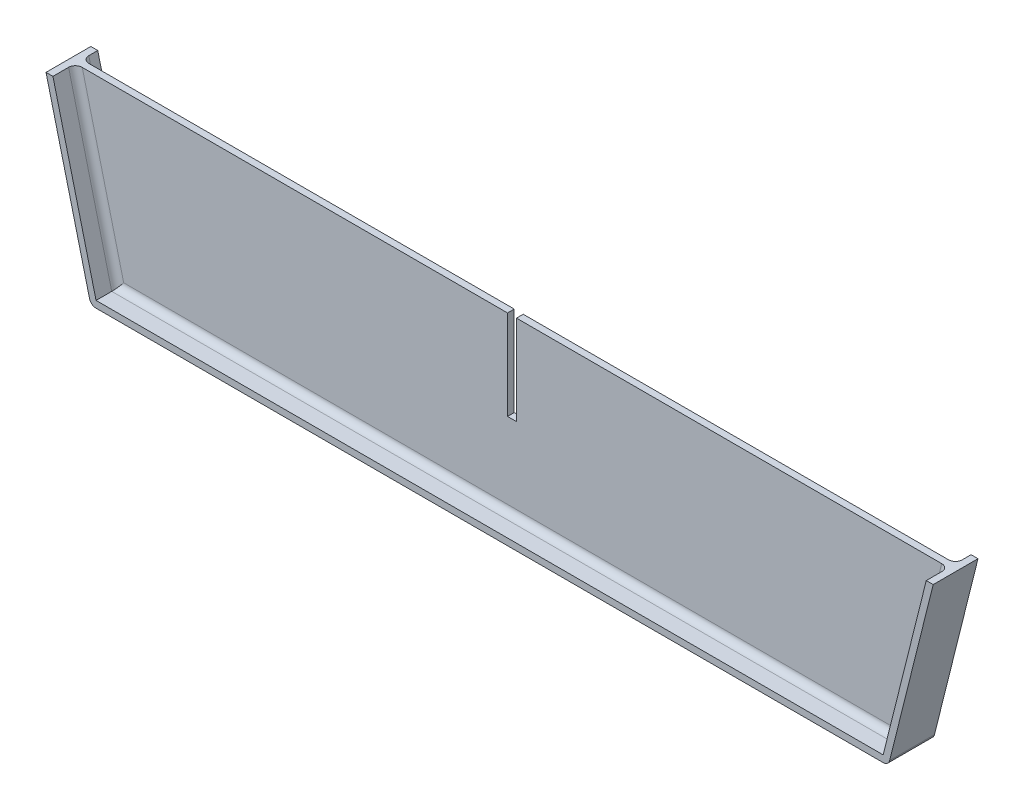
ISO-10303-21;
HEADER;
FILE_DESCRIPTION(('STEP AP214'),'2;1');
FILE_NAME('part.step','',(''),(''),'','','');
FILE_SCHEMA(('AUTOMOTIVE_DESIGN { 1 0 10303 214 1 1 1 1 }'));
ENDSEC;
DATA;
#1=APPLICATION_CONTEXT('core data for automotive mechanical design processes');
#2=APPLICATION_PROTOCOL_DEFINITION('international standard','automotive_design',2000,#1);
#3=PRODUCT_CONTEXT('',#1,'mechanical');
#4=PRODUCT('Part','Part','',(#3));
#5=PRODUCT_RELATED_PRODUCT_CATEGORY('part','',(#4));
#6=PRODUCT_DEFINITION_FORMATION('','',#4);
#7=PRODUCT_DEFINITION_CONTEXT('part definition',#1,'design');
#8=PRODUCT_DEFINITION('design','',#6,#7);
#9=PRODUCT_DEFINITION_SHAPE('','',#8);
#10=(LENGTH_UNIT() NAMED_UNIT(*) SI_UNIT(.MILLI.,.METRE.));
#11=(NAMED_UNIT(*) PLANE_ANGLE_UNIT() SI_UNIT($,.RADIAN.));
#12=(NAMED_UNIT(*) SI_UNIT($,.STERADIAN.) SOLID_ANGLE_UNIT());
#13=UNCERTAINTY_MEASURE_WITH_UNIT(LENGTH_MEASURE(1.E-05),#10,'distance_accuracy_value','');
#14=(GEOMETRIC_REPRESENTATION_CONTEXT(3) GLOBAL_UNCERTAINTY_ASSIGNED_CONTEXT((#13)) GLOBAL_UNIT_ASSIGNED_CONTEXT((#10,
#11,#12)) REPRESENTATION_CONTEXT('',''));
#15=CARTESIAN_POINT('',(0.,0.,0.));
#16=DIRECTION('',(0.,0.,1.));
#17=DIRECTION('',(1.,0.,0.));
#18=AXIS2_PLACEMENT_3D('',#15,#16,#17);
#19=CARTESIAN_POINT('',(0.,0.,1.5));
#20=DIRECTION('',(0.970142500145332,0.242535625036333,0.));
#21=DIRECTION('',(-0.242535625036333,0.970142500145332,0.));
#22=AXIS2_PLACEMENT_3D('',#19,#20,#21);
#23=PLANE('',#22);
#24=DIRECTION('',(0.242535625036333,-0.970142500145332,0.));
#25=VECTOR('',#24,1.);
#26=CARTESIAN_POINT('',(0.,0.,-3.5));
#27=LINE('',#26,#25);
#28=CARTESIAN_POINT('',(0.,0.,-3.5));
#29=VERTEX_POINT('',#28);
#30=CARTESIAN_POINT('',(9.71595085938863,-38.8638034375545,-3.5));
#31=VERTEX_POINT('',#30);
#32=EDGE_CURVE('E247',#29,#31,#27,.T.);
#33=ORIENTED_EDGE('',*,*,#32,.T.);
#34=DIRECTION('',(0.,0.,-1.));
#35=VECTOR('',#34,1.);
#36=CARTESIAN_POINT('',(9.71595085938863,-38.8638034375545,1.5));
#37=LINE('',#36,#35);
#38=CARTESIAN_POINT('',(9.71595085938863,-38.8638034375545,6.5));
#39=VERTEX_POINT('',#38);
#40=EDGE_CURVE('E60',#31,#39,#37,.F.);
#41=ORIENTED_EDGE('',*,*,#40,.T.);
#42=DIRECTION('',(0.242535625036333,-0.970142500145332,0.));
#43=VECTOR('',#42,1.);
#44=CARTESIAN_POINT('',(0.,0.,6.5));
#45=LINE('',#44,#43);
#46=CARTESIAN_POINT('',(0.,0.,6.5));
#47=VERTEX_POINT('',#46);
#48=EDGE_CURVE('E227',#47,#39,#45,.T.);
#49=ORIENTED_EDGE('',*,*,#48,.F.);
#50=DIRECTION('',(0.,0.,-1.));
#51=VECTOR('',#50,1.);
#52=CARTESIAN_POINT('',(0.,0.,1.5));
#53=LINE('',#52,#51);
#54=EDGE_CURVE('E277',#47,#29,#53,.T.);
#55=ORIENTED_EDGE('',*,*,#54,.T.);
#56=EDGE_LOOP('',(#33,#41,#49,#55));
#57=FACE_BOUND('',#56,.T.);
#58=ADVANCED_FACE('F35',(#57),#23,.F.);
#59=CARTESIAN_POINT('',(10.,-40.,1.5));
#60=DIRECTION('',(0.,1.,0.));
#61=DIRECTION('',(-1.,0.,0.));
#62=AXIS2_PLACEMENT_3D('',#59,#60,#61);
#63=PLANE('',#62);
#64=DIRECTION('',(1.,0.,0.));
#65=VECTOR('',#64,1.);
#66=CARTESIAN_POINT('',(10.,-40.,6.5));
#67=LINE('',#66,#65);
#68=CARTESIAN_POINT('',(11.1711646096066,-40.,6.5));
#69=VERTEX_POINT('',#68);
#70=CARTESIAN_POINT('',(186.828835390393,-40.,6.5));
#71=VERTEX_POINT('',#70);
#72=EDGE_CURVE('E196',#69,#71,#67,.T.);
#73=ORIENTED_EDGE('',*,*,#72,.F.);
#74=DIRECTION('',(0.,0.,-1.));
#75=VECTOR('',#74,1.);
#76=CARTESIAN_POINT('',(11.1711646096066,-40.,1.5));
#77=LINE('',#76,#75);
#78=CARTESIAN_POINT('',(11.1711646096066,-40.,-3.5));
#79=VERTEX_POINT('',#78);
#80=EDGE_CURVE('E326',#69,#79,#77,.T.);
#81=ORIENTED_EDGE('',*,*,#80,.T.);
#82=DIRECTION('',(1.,0.,0.));
#83=VECTOR('',#82,1.);
#84=CARTESIAN_POINT('',(10.,-40.,-3.5));
#85=LINE('',#84,#83);
#86=CARTESIAN_POINT('',(186.828835390393,-40.,-3.5));
#87=VERTEX_POINT('',#86);
#88=EDGE_CURVE('E229',#79,#87,#85,.T.);
#89=ORIENTED_EDGE('',*,*,#88,.T.);
#90=DIRECTION('',(0.,0.,-1.));
#91=VECTOR('',#90,1.);
#92=CARTESIAN_POINT('',(186.828835390393,-40.,1.5));
#93=LINE('',#92,#91);
#94=EDGE_CURVE('E324',#87,#71,#93,.F.);
#95=ORIENTED_EDGE('',*,*,#94,.T.);
#96=EDGE_LOOP('',(#73,#81,#89,#95));
#97=FACE_BOUND('',#96,.T.);
#98=ADVANCED_FACE('F411',(#97),#63,.F.);
#99=CARTESIAN_POINT('',(188.,-40.,1.5));
#100=DIRECTION('',(-0.970142500145332,0.242535625036333,0.));
#101=DIRECTION('',(-0.242535625036333,-0.970142500145332,0.));
#102=AXIS2_PLACEMENT_3D('',#99,#100,#101);
#103=PLANE('',#102);
#104=DIRECTION('',(0.242535625036333,0.970142500145332,0.));
#105=VECTOR('',#104,1.);
#106=CARTESIAN_POINT('',(188.,-40.,6.5));
#107=LINE('',#106,#105);
#108=CARTESIAN_POINT('',(188.284049140611,-38.8638034375545,6.5));
#109=VERTEX_POINT('',#108);
#110=CARTESIAN_POINT('',(198.,0.,6.5));
#111=VERTEX_POINT('',#110);
#112=EDGE_CURVE('E186',#109,#111,#107,.T.);
#113=ORIENTED_EDGE('',*,*,#112,.F.);
#114=DIRECTION('',(0.,0.,-1.));
#115=VECTOR('',#114,1.);
#116=CARTESIAN_POINT('',(188.284049140611,-38.8638034375545,1.5));
#117=LINE('',#116,#115);
#118=CARTESIAN_POINT('',(188.284049140611,-38.8638034375545,-3.5));
#119=VERTEX_POINT('',#118);
#120=EDGE_CURVE('E337',#109,#119,#117,.T.);
#121=ORIENTED_EDGE('',*,*,#120,.T.);
#122=DIRECTION('',(0.242535625036333,0.970142500145332,0.));
#123=VECTOR('',#122,1.);
#124=CARTESIAN_POINT('',(188.,-40.,-3.5));
#125=LINE('',#124,#123);
#126=CARTESIAN_POINT('',(198.,0.,-3.5));
#127=VERTEX_POINT('',#126);
#128=EDGE_CURVE('E202',#119,#127,#125,.T.);
#129=ORIENTED_EDGE('',*,*,#128,.T.);
#130=DIRECTION('',(0.,0.,-1.));
#131=VECTOR('',#130,1.);
#132=CARTESIAN_POINT('',(198.,0.,1.5));
#133=LINE('',#132,#131);
#134=EDGE_CURVE('E199',#111,#127,#133,.T.);
#135=ORIENTED_EDGE('',*,*,#134,.F.);
#136=EDGE_LOOP('',(#113,#121,#129,#135));
#137=FACE_BOUND('',#136,.T.);
#138=ADVANCED_FACE('F200',(#137),#103,.F.);
#139=CARTESIAN_POINT('',(100.,0.,1.5));
#140=DIRECTION('',(0.,-1.,0.));
#141=DIRECTION('',(0.,0.,-1.));
#142=AXIS2_PLACEMENT_3D('',#139,#140,#141);
#143=PLANE('',#142);
#144=DIRECTION('',(-1.,0.,0.));
#145=VECTOR('',#144,1.);
#146=CARTESIAN_POINT('',(100.,0.,1.5));
#147=LINE('',#146,#145);
#148=CARTESIAN_POINT('',(194.907670780787,0.,1.5));
#149=VERTEX_POINT('',#148);
#150=CARTESIAN_POINT('',(100.,0.,1.5));
#151=VERTEX_POINT('',#150);
#152=EDGE_CURVE('E265',#149,#151,#147,.T.);
#153=ORIENTED_EDGE('',*,*,#152,.F.);
#154=CARTESIAN_POINT('',(194.907670780787,0.,3.));
#155=DIRECTION('',(0.,-1.,0.));
#156=DIRECTION('',(1.,0.,0.));
#157=AXIS2_PLACEMENT_3D('',#154,#155,#156);
#158=ELLIPSE('',#157,1.54616460960662,1.5);
#159=CARTESIAN_POINT('',(196.453835390393,0.,3.));
#160=VERTEX_POINT('',#159);
#161=EDGE_CURVE('E341',#149,#160,#158,.T.);
#162=ORIENTED_EDGE('',*,*,#161,.T.);
#163=DIRECTION('',(0.,0.,1.));
#164=VECTOR('',#163,1.);
#165=CARTESIAN_POINT('',(196.453835390393,0.,-3.5));
#166=LINE('',#165,#164);
#167=CARTESIAN_POINT('',(196.453835390393,0.,6.5));
#168=VERTEX_POINT('',#167);
#169=EDGE_CURVE('E212',#160,#168,#166,.T.);
#170=ORIENTED_EDGE('',*,*,#169,.T.);
#171=DIRECTION('',(-1.,0.,0.));
#172=VECTOR('',#171,1.);
#173=CARTESIAN_POINT('',(196.453835390393,0.,6.5));
#174=LINE('',#173,#172);
#175=EDGE_CURVE('E191',#111,#168,#174,.T.);
#176=ORIENTED_EDGE('',*,*,#175,.F.);
#177=ORIENTED_EDGE('',*,*,#134,.T.);
#178=DIRECTION('',(-1.,0.,0.));
#179=VECTOR('',#178,1.);
#180=CARTESIAN_POINT('',(196.453835390393,0.,-3.5));
#181=LINE('',#180,#179);
#182=CARTESIAN_POINT('',(196.453835390393,0.,-3.5));
#183=VERTEX_POINT('',#182);
#184=EDGE_CURVE('E233',#127,#183,#181,.T.);
#185=ORIENTED_EDGE('',*,*,#184,.T.);
#186=CARTESIAN_POINT('',(196.453835390393,0.,-1.5));
#187=VERTEX_POINT('',#186);
#188=EDGE_CURVE('E262',#183,#187,#166,.T.);
#189=ORIENTED_EDGE('',*,*,#188,.T.);
#190=CARTESIAN_POINT('',(194.907670780787,0.,-1.5));
#191=DIRECTION('',(0.,-1.,0.));
#192=DIRECTION('',(-1.,0.,0.));
#193=AXIS2_PLACEMENT_3D('',#190,#191,#192);
#194=ELLIPSE('',#193,1.54616460960662,1.5);
#195=CARTESIAN_POINT('',(194.907670780787,0.,0.));
#196=VERTEX_POINT('',#195);
#197=EDGE_CURVE('E44',#187,#196,#194,.T.);
#198=ORIENTED_EDGE('',*,*,#197,.T.);
#199=DIRECTION('',(-1.,0.,0.));
#200=VECTOR('',#199,1.);
#201=CARTESIAN_POINT('',(100.,0.,0.));
#202=LINE('',#201,#200);
#203=CARTESIAN_POINT('',(100.,0.,0.));
#204=VERTEX_POINT('',#203);
#205=EDGE_CURVE('E252',#196,#204,#202,.T.);
#206=ORIENTED_EDGE('',*,*,#205,.T.);
#207=DIRECTION('',(0.,0.,-1.));
#208=VECTOR('',#207,1.);
#209=CARTESIAN_POINT('',(100.,0.,1.5));
#210=LINE('',#209,#208);
#211=EDGE_CURVE('E207',#151,#204,#210,.T.);
#212=ORIENTED_EDGE('',*,*,#211,.F.);
#213=EDGE_LOOP('',(#153,#162,#170,#176,#177,#185,#189,#198,#206,#212));
#214=FACE_BOUND('',#213,.T.);
#215=ADVANCED_FACE('F210',(#214),#143,.F.);
#216=CARTESIAN_POINT('',(100.,0.,1.5));
#217=DIRECTION('',(1.,0.,0.));
#218=DIRECTION('',(0.,1.,0.));
#219=AXIS2_PLACEMENT_3D('',#216,#217,#218);
#220=PLANE('',#219);
#221=DIRECTION('',(0.,-1.,0.));
#222=VECTOR('',#221,1.);
#223=CARTESIAN_POINT('',(100.,0.,0.));
#224=LINE('',#223,#222);
#225=CARTESIAN_POINT('',(100.,-20.,0.));
#226=VERTEX_POINT('',#225);
#227=EDGE_CURVE('E279',#204,#226,#224,.T.);
#228=ORIENTED_EDGE('',*,*,#227,.T.);
#229=DIRECTION('',(0.,0.,-1.));
#230=VECTOR('',#229,1.);
#231=CARTESIAN_POINT('',(100.,-20.,1.5));
#232=LINE('',#231,#230);
#233=CARTESIAN_POINT('',(100.,-20.,1.5));
#234=VERTEX_POINT('',#233);
#235=EDGE_CURVE('E294',#234,#226,#232,.T.);
#236=ORIENTED_EDGE('',*,*,#235,.F.);
#237=DIRECTION('',(0.,-1.,0.));
#238=VECTOR('',#237,1.);
#239=CARTESIAN_POINT('',(100.,0.,1.5));
#240=LINE('',#239,#238);
#241=EDGE_CURVE('E267',#151,#234,#240,.T.);
#242=ORIENTED_EDGE('',*,*,#241,.F.);
#243=ORIENTED_EDGE('',*,*,#211,.T.);
#244=EDGE_LOOP('',(#228,#236,#242,#243));
#245=FACE_BOUND('',#244,.T.);
#246=ADVANCED_FACE('F386',(#245),#220,.F.);
#247=CARTESIAN_POINT('',(98.,-20.,1.5));
#248=DIRECTION('',(0.,-1.,0.));
#249=DIRECTION('',(0.,0.,-1.));
#250=AXIS2_PLACEMENT_3D('',#247,#248,#249);
#251=PLANE('',#250);
#252=DIRECTION('',(-1.,0.,0.));
#253=VECTOR('',#252,1.);
#254=CARTESIAN_POINT('',(98.,-20.,0.));
#255=LINE('',#254,#253);
#256=CARTESIAN_POINT('',(98.,-20.,0.));
#257=VERTEX_POINT('',#256);
#258=EDGE_CURVE('E281',#226,#257,#255,.T.);
#259=ORIENTED_EDGE('',*,*,#258,.T.);
#260=DIRECTION('',(0.,0.,-1.));
#261=VECTOR('',#260,1.);
#262=CARTESIAN_POINT('',(98.,-20.,1.5));
#263=LINE('',#262,#261);
#264=CARTESIAN_POINT('',(98.,-20.,1.5));
#265=VERTEX_POINT('',#264);
#266=EDGE_CURVE('E291',#265,#257,#263,.T.);
#267=ORIENTED_EDGE('',*,*,#266,.F.);
#268=DIRECTION('',(-1.,0.,0.));
#269=VECTOR('',#268,1.);
#270=CARTESIAN_POINT('',(98.,-20.,1.5));
#271=LINE('',#270,#269);
#272=EDGE_CURVE('E270',#234,#265,#271,.T.);
#273=ORIENTED_EDGE('',*,*,#272,.F.);
#274=ORIENTED_EDGE('',*,*,#235,.T.);
#275=EDGE_LOOP('',(#259,#267,#273,#274));
#276=FACE_BOUND('',#275,.T.);
#277=ADVANCED_FACE('F381',(#276),#251,.F.);
#278=CARTESIAN_POINT('',(98.,0.,1.5));
#279=DIRECTION('',(-1.,0.,0.));
#280=DIRECTION('',(0.,-1.,0.));
#281=AXIS2_PLACEMENT_3D('',#278,#279,#280);
#282=PLANE('',#281);
#283=DIRECTION('',(0.,1.,0.));
#284=VECTOR('',#283,1.);
#285=CARTESIAN_POINT('',(98.,0.,0.));
#286=LINE('',#285,#284);
#287=CARTESIAN_POINT('',(98.,0.,0.));
#288=VERTEX_POINT('',#287);
#289=EDGE_CURVE('E283',#257,#288,#286,.T.);
#290=ORIENTED_EDGE('',*,*,#289,.T.);
#291=DIRECTION('',(0.,0.,-1.));
#292=VECTOR('',#291,1.);
#293=CARTESIAN_POINT('',(98.,0.,1.5));
#294=LINE('',#293,#292);
#295=CARTESIAN_POINT('',(98.,0.,1.5));
#296=VERTEX_POINT('',#295);
#297=EDGE_CURVE('E288',#296,#288,#294,.T.);
#298=ORIENTED_EDGE('',*,*,#297,.F.);
#299=DIRECTION('',(0.,1.,0.));
#300=VECTOR('',#299,1.);
#301=CARTESIAN_POINT('',(98.,0.,1.5));
#302=LINE('',#301,#300);
#303=EDGE_CURVE('E272',#265,#296,#302,.T.);
#304=ORIENTED_EDGE('',*,*,#303,.F.);
#305=ORIENTED_EDGE('',*,*,#266,.T.);
#306=EDGE_LOOP('',(#290,#298,#304,#305));
#307=FACE_BOUND('',#306,.T.);
#308=ADVANCED_FACE('F376',(#307),#282,.F.);
#309=CARTESIAN_POINT('',(0.,0.,1.5));
#310=DIRECTION('',(0.,-1.,0.));
#311=DIRECTION('',(0.,0.,-1.));
#312=AXIS2_PLACEMENT_3D('',#309,#310,#311);
#313=PLANE('',#312);
#314=DIRECTION('',(-1.,0.,0.));
#315=VECTOR('',#314,1.);
#316=CARTESIAN_POINT('',(0.,0.,0.));
#317=LINE('',#316,#315);
#318=CARTESIAN_POINT('',(3.09232921921324,0.,0.));
#319=VERTEX_POINT('',#318);
#320=EDGE_CURVE('E268',#288,#319,#317,.T.);
#321=ORIENTED_EDGE('',*,*,#320,.T.);
#322=CARTESIAN_POINT('',(3.09232921921324,0.,-1.5));
#323=DIRECTION('',(0.,-1.,0.));
#324=DIRECTION('',(-1.,0.,0.));
#325=AXIS2_PLACEMENT_3D('',#322,#323,#324);
#326=ELLIPSE('',#325,1.54616460960662,1.5);
#327=CARTESIAN_POINT('',(1.54616460960662,0.,-1.5));
#328=VERTEX_POINT('',#327);
#329=EDGE_CURVE('E11',#319,#328,#326,.T.);
#330=ORIENTED_EDGE('',*,*,#329,.T.);
#331=DIRECTION('',(0.,0.,1.));
#332=VECTOR('',#331,1.);
#333=CARTESIAN_POINT('',(1.54616460960662,0.,-3.5));
#334=LINE('',#333,#332);
#335=CARTESIAN_POINT('',(1.54616460960662,0.,-3.5));
#336=VERTEX_POINT('',#335);
#337=EDGE_CURVE('E249',#336,#328,#334,.T.);
#338=ORIENTED_EDGE('',*,*,#337,.F.);
#339=DIRECTION('',(-1.,0.,0.));
#340=VECTOR('',#339,1.);
#341=CARTESIAN_POINT('',(1.54616460960662,0.,-3.5));
#342=LINE('',#341,#340);
#343=EDGE_CURVE('E244',#336,#29,#342,.T.);
#344=ORIENTED_EDGE('',*,*,#343,.T.);
#345=ORIENTED_EDGE('',*,*,#54,.F.);
#346=DIRECTION('',(-1.,0.,0.));
#347=VECTOR('',#346,1.);
#348=CARTESIAN_POINT('',(1.54616460960662,0.,6.5));
#349=LINE('',#348,#347);
#350=CARTESIAN_POINT('',(1.54616460960662,0.,6.5));
#351=VERTEX_POINT('',#350);
#352=EDGE_CURVE('E224',#351,#47,#349,.T.);
#353=ORIENTED_EDGE('',*,*,#352,.F.);
#354=CARTESIAN_POINT('',(1.54616460960662,0.,3.));
#355=VERTEX_POINT('',#354);
#356=EDGE_CURVE('E253',#355,#351,#334,.T.);
#357=ORIENTED_EDGE('',*,*,#356,.F.);
#358=CARTESIAN_POINT('',(3.09232921921324,0.,3.));
#359=DIRECTION('',(0.,-1.,0.));
#360=DIRECTION('',(1.,0.,0.));
#361=AXIS2_PLACEMENT_3D('',#358,#359,#360);
#362=ELLIPSE('',#361,1.54616460960662,1.5);
#363=CARTESIAN_POINT('',(3.09232921921324,0.,1.5));
#364=VERTEX_POINT('',#363);
#365=EDGE_CURVE('E339',#355,#364,#362,.T.);
#366=ORIENTED_EDGE('',*,*,#365,.T.);
#367=DIRECTION('',(-1.,0.,0.));
#368=VECTOR('',#367,1.);
#369=CARTESIAN_POINT('',(0.,0.,1.5));
#370=LINE('',#369,#368);
#371=EDGE_CURVE('E274',#296,#364,#370,.T.);
#372=ORIENTED_EDGE('',*,*,#371,.F.);
#373=ORIENTED_EDGE('',*,*,#297,.T.);
#374=EDGE_LOOP('',(#321,#330,#338,#344,#345,#353,#357,#366,#372,#373));
#375=FACE_BOUND('',#374,.T.);
#376=ADVANCED_FACE('F371',(#375),#313,.F.);
#377=CARTESIAN_POINT('',(0.,0.,1.5));
#378=DIRECTION('',(0.,0.,1.));
#379=DIRECTION('',(1.,0.,0.));
#380=AXIS2_PLACEMENT_3D('',#377,#378,#379);
#381=PLANE('',#380);
#382=ORIENTED_EDGE('',*,*,#371,.T.);
#383=DIRECTION('',(-0.242535625036333,0.970142500145332,0.));
#384=VECTOR('',#383,1.);
#385=CARTESIAN_POINT('',(12.6263783598246,-38.1361965624455,1.5));
#386=LINE('',#385,#384);
#387=CARTESIAN_POINT('',(12.3423292192133,-37.,1.5));
#388=VERTEX_POINT('',#387);
#389=EDGE_CURVE('E305',#364,#388,#386,.F.);
#390=ORIENTED_EDGE('',*,*,#389,.T.);
#391=DIRECTION('',(-1.,0.,0.));
#392=VECTOR('',#391,1.);
#393=CARTESIAN_POINT('',(186.828835390393,-37.,1.5));
#394=LINE('',#393,#392);
#395=CARTESIAN_POINT('',(185.657670780787,-37.,1.5));
#396=VERTEX_POINT('',#395);
#397=EDGE_CURVE('E303',#388,#396,#394,.F.);
#398=ORIENTED_EDGE('',*,*,#397,.T.);
#399=DIRECTION('',(-0.242535625036332,-0.970142500145332,0.));
#400=VECTOR('',#399,1.);
#401=CARTESIAN_POINT('',(194.998621640175,0.363803437554509,1.5));
#402=LINE('',#401,#400);
#403=EDGE_CURVE('E301',#396,#149,#402,.F.);
#404=ORIENTED_EDGE('',*,*,#403,.T.);
#405=ORIENTED_EDGE('',*,*,#152,.T.);
#406=ORIENTED_EDGE('',*,*,#241,.T.);
#407=ORIENTED_EDGE('',*,*,#272,.T.);
#408=ORIENTED_EDGE('',*,*,#303,.T.);
#409=EDGE_LOOP('',(#382,#390,#398,#404,#405,#406,#407,#408));
#410=FACE_BOUND('',#409,.T.);
#411=ADVANCED_FACE('F554',(#410),#381,.T.);
#412=CARTESIAN_POINT('',(0.,0.,0.));
#413=DIRECTION('',(0.,0.,1.));
#414=DIRECTION('',(1.,0.,0.));
#415=AXIS2_PLACEMENT_3D('',#412,#413,#414);
#416=PLANE('',#415);
#417=ORIENTED_EDGE('',*,*,#205,.F.);
#418=DIRECTION('',(-0.242535625036332,-0.970142500145332,0.));
#419=VECTOR('',#418,1.);
#420=CARTESIAN_POINT('',(183.442513676035,-45.8606284190085,0.));
#421=LINE('',#420,#419);
#422=CARTESIAN_POINT('',(185.657670780787,-37.,0.));
#423=VERTEX_POINT('',#422);
#424=EDGE_CURVE('E315',#196,#423,#421,.T.);
#425=ORIENTED_EDGE('',*,*,#424,.T.);
#426=DIRECTION('',(-1.,0.,0.));
#427=VECTOR('',#426,1.);
#428=CARTESIAN_POINT('',(0.,-37.,0.));
#429=LINE('',#428,#427);
#430=CARTESIAN_POINT('',(12.3423292192133,-37.,0.));
#431=VERTEX_POINT('',#430);
#432=EDGE_CURVE('E313',#423,#431,#429,.T.);
#433=ORIENTED_EDGE('',*,*,#432,.T.);
#434=DIRECTION('',(-0.242535625036333,0.970142500145332,0.));
#435=VECTOR('',#434,1.);
#436=CARTESIAN_POINT('',(2.91042750043599,0.727606875108998,0.));
#437=LINE('',#436,#435);
#438=EDGE_CURVE('E311',#431,#319,#437,.T.);
#439=ORIENTED_EDGE('',*,*,#438,.T.);
#440=ORIENTED_EDGE('',*,*,#320,.F.);
#441=ORIENTED_EDGE('',*,*,#289,.F.);
#442=ORIENTED_EDGE('',*,*,#258,.F.);
#443=ORIENTED_EDGE('',*,*,#227,.F.);
#444=EDGE_LOOP('',(#417,#425,#433,#439,#440,#441,#442,#443));
#445=FACE_BOUND('',#444,.T.);
#446=ADVANCED_FACE('F368',(#445),#416,.F.);
#447=CARTESIAN_POINT('',(0.,0.,-3.5));
#448=DIRECTION('',(0.,0.,1.));
#449=DIRECTION('',(1.,0.,0.));
#450=AXIS2_PLACEMENT_3D('',#447,#448,#449);
#451=PLANE('',#450);
#452=ORIENTED_EDGE('',*,*,#88,.F.);
#453=CARTESIAN_POINT('',(11.1711646096066,-38.5,-3.5));
#454=DIRECTION('',(0.,0.,1.));
#455=DIRECTION('',(1.,0.,0.));
#456=AXIS2_PLACEMENT_3D('',#453,#454,#455);
#457=CIRCLE('',#456,1.5);
#458=EDGE_CURVE('E331',#79,#31,#457,.F.);
#459=ORIENTED_EDGE('',*,*,#458,.T.);
#460=ORIENTED_EDGE('',*,*,#32,.F.);
#461=ORIENTED_EDGE('',*,*,#343,.F.);
#462=DIRECTION('',(-0.242535625036333,0.970142500145332,0.));
#463=VECTOR('',#462,1.);
#464=CARTESIAN_POINT('',(1.54616460960662,0.,-3.5));
#465=LINE('',#464,#463);
#466=CARTESIAN_POINT('',(11.1711646096066,-38.5,-3.5));
#467=VERTEX_POINT('',#466);
#468=EDGE_CURVE('E241',#467,#336,#465,.T.);
#469=ORIENTED_EDGE('',*,*,#468,.F.);
#470=DIRECTION('',(-1.,0.,0.));
#471=VECTOR('',#470,1.);
#472=CARTESIAN_POINT('',(11.1711646096066,-38.5,-3.5));
#473=LINE('',#472,#471);
#474=CARTESIAN_POINT('',(186.828835390393,-38.5,-3.5));
#475=VERTEX_POINT('',#474);
#476=EDGE_CURVE('E238',#475,#467,#473,.T.);
#477=ORIENTED_EDGE('',*,*,#476,.F.);
#478=DIRECTION('',(-0.242535625036332,-0.970142500145332,0.));
#479=VECTOR('',#478,1.);
#480=CARTESIAN_POINT('',(186.828835390393,-38.5,-3.5));
#481=LINE('',#480,#479);
#482=EDGE_CURVE('E235',#183,#475,#481,.T.);
#483=ORIENTED_EDGE('',*,*,#482,.F.);
#484=ORIENTED_EDGE('',*,*,#184,.F.);
#485=ORIENTED_EDGE('',*,*,#128,.F.);
#486=CARTESIAN_POINT('',(186.828835390393,-38.5,-3.5));
#487=DIRECTION('',(0.,0.,1.));
#488=DIRECTION('',(1.,0.,0.));
#489=AXIS2_PLACEMENT_3D('',#486,#487,#488);
#490=CIRCLE('',#489,1.5);
#491=EDGE_CURVE('E329',#119,#87,#490,.F.);
#492=ORIENTED_EDGE('',*,*,#491,.T.);
#493=EDGE_LOOP('',(#452,#459,#460,#461,#469,#477,#483,#484,#485,#492));
#494=FACE_BOUND('',#493,.T.);
#495=ADVANCED_FACE('F396',(#494),#451,.F.);
#496=CARTESIAN_POINT('',(186.828835390393,-38.5,-3.5));
#497=DIRECTION('',(-0.970142500145332,0.242535625036332,0.));
#498=DIRECTION('',(-0.242535625036332,-0.970142500145332,0.));
#499=AXIS2_PLACEMENT_3D('',#496,#497,#498);
#500=PLANE('',#499);
#501=DIRECTION('',(0.,0.,1.));
#502=VECTOR('',#501,1.);
#503=CARTESIAN_POINT('',(186.828835390393,-38.5,-3.5));
#504=LINE('',#503,#502);
#505=CARTESIAN_POINT('',(186.828835390393,-38.5,-1.5));
#506=VERTEX_POINT('',#505);
#507=EDGE_CURVE('E258',#475,#506,#504,.T.);
#508=ORIENTED_EDGE('',*,*,#507,.T.);
#509=DIRECTION('',(-0.242535625036332,-0.970142500145332,0.));
#510=VECTOR('',#509,1.);
#511=CARTESIAN_POINT('',(186.828835390393,-38.5,-1.5));
#512=LINE('',#511,#510);
#513=EDGE_CURVE('E318',#506,#187,#512,.F.);
#514=ORIENTED_EDGE('',*,*,#513,.T.);
#515=ORIENTED_EDGE('',*,*,#188,.F.);
#516=ORIENTED_EDGE('',*,*,#482,.T.);
#517=EDGE_LOOP('',(#508,#514,#515,#516));
#518=FACE_BOUND('',#517,.T.);
#519=ADVANCED_FACE('F392',(#518),#500,.T.);
#520=CARTESIAN_POINT('',(11.1711646096066,-38.5,-3.5));
#521=DIRECTION('',(0.,1.,0.));
#522=DIRECTION('',(-1.,0.,0.));
#523=AXIS2_PLACEMENT_3D('',#520,#521,#522);
#524=PLANE('',#523);
#525=DIRECTION('',(0.,0.,1.));
#526=VECTOR('',#525,1.);
#527=CARTESIAN_POINT('',(11.1711646096066,-38.5,-3.5));
#528=LINE('',#527,#526);
#529=CARTESIAN_POINT('',(11.1711646096066,-38.5,-1.5));
#530=VERTEX_POINT('',#529);
#531=EDGE_CURVE('E254',#467,#530,#528,.T.);
#532=ORIENTED_EDGE('',*,*,#531,.T.);
#533=DIRECTION('',(-1.,0.,0.));
#534=VECTOR('',#533,1.);
#535=CARTESIAN_POINT('',(11.1711646096066,-38.5,-1.5));
#536=LINE('',#535,#534);
#537=EDGE_CURVE('E320',#530,#506,#536,.F.);
#538=ORIENTED_EDGE('',*,*,#537,.T.);
#539=ORIENTED_EDGE('',*,*,#507,.F.);
#540=ORIENTED_EDGE('',*,*,#476,.T.);
#541=EDGE_LOOP('',(#532,#538,#539,#540));
#542=FACE_BOUND('',#541,.T.);
#543=ADVANCED_FACE('F401',(#542),#524,.T.);
#544=CARTESIAN_POINT('',(1.54616460960662,0.,-3.5));
#545=DIRECTION('',(0.970142500145332,0.242535625036333,0.));
#546=DIRECTION('',(-0.242535625036333,0.970142500145332,0.));
#547=AXIS2_PLACEMENT_3D('',#544,#545,#546);
#548=PLANE('',#547);
#549=ORIENTED_EDGE('',*,*,#337,.T.);
#550=DIRECTION('',(-0.242535625036333,0.970142500145332,0.));
#551=VECTOR('',#550,1.);
#552=CARTESIAN_POINT('',(1.54616460960662,0.,-1.5));
#553=LINE('',#552,#551);
#554=EDGE_CURVE('E322',#328,#530,#553,.F.);
#555=ORIENTED_EDGE('',*,*,#554,.T.);
#556=ORIENTED_EDGE('',*,*,#531,.F.);
#557=ORIENTED_EDGE('',*,*,#468,.T.);
#558=EDGE_LOOP('',(#549,#555,#556,#557));
#559=FACE_BOUND('',#558,.T.);
#560=ADVANCED_FACE('F403',(#559),#548,.T.);
#561=CARTESIAN_POINT('',(11.1711646096066,-38.5,3.));
#562=VERTEX_POINT('',#561);
#563=CARTESIAN_POINT('',(11.1711646096066,-38.5,6.5));
#564=VERTEX_POINT('',#563);
#565=EDGE_CURVE('E257',#562,#564,#528,.T.);
#566=ORIENTED_EDGE('',*,*,#565,.F.);
#567=DIRECTION('',(-0.242535625036333,0.970142500145332,0.));
#568=VECTOR('',#567,1.);
#569=CARTESIAN_POINT('',(1.54616460960662,0.,3.));
#570=LINE('',#569,#568);
#571=EDGE_CURVE('E206',#562,#355,#570,.T.);
#572=ORIENTED_EDGE('',*,*,#571,.T.);
#573=ORIENTED_EDGE('',*,*,#356,.T.);
#574=DIRECTION('',(-0.242535625036333,0.970142500145332,0.));
#575=VECTOR('',#574,1.);
#576=CARTESIAN_POINT('',(1.54616460960662,0.,6.5));
#577=LINE('',#576,#575);
#578=EDGE_CURVE('E221',#564,#351,#577,.T.);
#579=ORIENTED_EDGE('',*,*,#578,.F.);
#580=EDGE_LOOP('',(#566,#572,#573,#579));
#581=FACE_BOUND('',#580,.T.);
#582=ADVANCED_FACE('F510',(#581),#548,.T.);
#583=CARTESIAN_POINT('',(186.828835390393,-38.5,3.));
#584=VERTEX_POINT('',#583);
#585=CARTESIAN_POINT('',(186.828835390393,-38.5,6.5));
#586=VERTEX_POINT('',#585);
#587=EDGE_CURVE('E261',#584,#586,#504,.T.);
#588=ORIENTED_EDGE('',*,*,#587,.F.);
#589=DIRECTION('',(-1.,0.,0.));
#590=VECTOR('',#589,1.);
#591=CARTESIAN_POINT('',(11.1711646096066,-38.5,3.));
#592=LINE('',#591,#590);
#593=EDGE_CURVE('E307',#584,#562,#592,.T.);
#594=ORIENTED_EDGE('',*,*,#593,.T.);
#595=ORIENTED_EDGE('',*,*,#565,.T.);
#596=DIRECTION('',(-1.,0.,0.));
#597=VECTOR('',#596,1.);
#598=CARTESIAN_POINT('',(11.1711646096066,-38.5,6.5));
#599=LINE('',#598,#597);
#600=EDGE_CURVE('E215',#586,#564,#599,.T.);
#601=ORIENTED_EDGE('',*,*,#600,.F.);
#602=EDGE_LOOP('',(#588,#594,#595,#601));
#603=FACE_BOUND('',#602,.T.);
#604=ADVANCED_FACE('F501',(#603),#524,.T.);
#605=ORIENTED_EDGE('',*,*,#169,.F.);
#606=DIRECTION('',(-0.242535625036332,-0.970142500145332,0.));
#607=VECTOR('',#606,1.);
#608=CARTESIAN_POINT('',(186.828835390393,-38.5,3.));
#609=LINE('',#608,#607);
#610=EDGE_CURVE('E309',#160,#584,#609,.T.);
#611=ORIENTED_EDGE('',*,*,#610,.T.);
#612=ORIENTED_EDGE('',*,*,#587,.T.);
#613=DIRECTION('',(-0.242535625036332,-0.970142500145332,0.));
#614=VECTOR('',#613,1.);
#615=CARTESIAN_POINT('',(186.828835390393,-38.5,6.5));
#616=LINE('',#615,#614);
#617=EDGE_CURVE('E213',#168,#586,#616,.T.);
#618=ORIENTED_EDGE('',*,*,#617,.F.);
#619=EDGE_LOOP('',(#605,#611,#612,#618));
#620=FACE_BOUND('',#619,.T.);
#621=ADVANCED_FACE('F493',(#620),#500,.T.);
#622=CARTESIAN_POINT('',(0.,0.,6.5));
#623=DIRECTION('',(0.,0.,1.));
#624=DIRECTION('',(1.,0.,0.));
#625=AXIS2_PLACEMENT_3D('',#622,#623,#624);
#626=PLANE('',#625);
#627=ORIENTED_EDGE('',*,*,#48,.T.);
#628=CARTESIAN_POINT('',(11.1711646096066,-38.5,6.5));
#629=DIRECTION('',(0.,0.,1.));
#630=DIRECTION('',(1.,0.,0.));
#631=AXIS2_PLACEMENT_3D('',#628,#629,#630);
#632=CIRCLE('',#631,1.5);
#633=EDGE_CURVE('E335',#39,#69,#632,.T.);
#634=ORIENTED_EDGE('',*,*,#633,.T.);
#635=ORIENTED_EDGE('',*,*,#72,.T.);
#636=CARTESIAN_POINT('',(186.828835390393,-38.5,6.5));
#637=DIRECTION('',(0.,0.,1.));
#638=DIRECTION('',(1.,0.,0.));
#639=AXIS2_PLACEMENT_3D('',#636,#637,#638);
#640=CIRCLE('',#639,1.5);
#641=EDGE_CURVE('E52',#71,#109,#640,.T.);
#642=ORIENTED_EDGE('',*,*,#641,.T.);
#643=ORIENTED_EDGE('',*,*,#112,.T.);
#644=ORIENTED_EDGE('',*,*,#175,.T.);
#645=ORIENTED_EDGE('',*,*,#617,.T.);
#646=ORIENTED_EDGE('',*,*,#600,.T.);
#647=ORIENTED_EDGE('',*,*,#578,.T.);
#648=ORIENTED_EDGE('',*,*,#352,.T.);
#649=EDGE_LOOP('',(#627,#634,#635,#642,#643,#644,#645,#646,#647,#648));
#650=FACE_BOUND('',#649,.T.);
#651=ADVANCED_FACE('F188',(#650),#626,.T.);
#652=CARTESIAN_POINT('',(185.373621640175,-38.1361965624455,3.));
#653=DIRECTION('',(0.242535625036332,0.970142500145332,0.));
#654=DIRECTION('',(-0.970142500145332,0.242535625036332,0.));
#655=AXIS2_PLACEMENT_3D('',#652,#653,#654);
#656=CYLINDRICAL_SURFACE('',#655,1.5);
#657=ORIENTED_EDGE('',*,*,#161,.F.);
#658=ORIENTED_EDGE('',*,*,#403,.F.);
#659=CARTESIAN_POINT('',(185.657670780787,-37.,3.));
#660=DIRECTION('',(0.788205438016109,0.615412209402636,0.));
#661=DIRECTION('',(0.615412209402636,-0.788205438016109,0.));
#662=AXIS2_PLACEMENT_3D('',#659,#660,#661);
#663=ELLIPSE('',#662,1.90305715699635,1.5);
#664=EDGE_CURVE('E347',#584,#396,#663,.T.);
#665=ORIENTED_EDGE('',*,*,#664,.F.);
#666=ORIENTED_EDGE('',*,*,#610,.F.);
#667=EDGE_LOOP('',(#657,#658,#665,#666));
#668=FACE_BOUND('',#667,.T.);
#669=ADVANCED_FACE('F433',(#668),#656,.F.);
#670=CARTESIAN_POINT('',(11.1711646096066,-37.,3.));
#671=DIRECTION('',(1.,0.,0.));
#672=DIRECTION('',(0.,1.,0.));
#673=AXIS2_PLACEMENT_3D('',#670,#671,#672);
#674=CYLINDRICAL_SURFACE('',#673,1.5);
#675=ORIENTED_EDGE('',*,*,#664,.T.);
#676=ORIENTED_EDGE('',*,*,#397,.F.);
#677=CARTESIAN_POINT('',(12.3423292192133,-37.,3.));
#678=DIRECTION('',(0.788205438016109,-0.615412209402636,0.));
#679=DIRECTION('',(-0.615412209402636,-0.788205438016109,0.));
#680=AXIS2_PLACEMENT_3D('',#677,#678,#679);
#681=ELLIPSE('',#680,1.90305715699635,1.5);
#682=EDGE_CURVE('E344',#562,#388,#681,.T.);
#683=ORIENTED_EDGE('',*,*,#682,.F.);
#684=ORIENTED_EDGE('',*,*,#593,.F.);
#685=EDGE_LOOP('',(#675,#676,#683,#684));
#686=FACE_BOUND('',#685,.T.);
#687=ADVANCED_FACE('F429',(#686),#674,.F.);
#688=CARTESIAN_POINT('',(3.00137835982462,0.3638034375545,3.));
#689=DIRECTION('',(0.242535625036333,-0.970142500145332,0.));
#690=DIRECTION('',(0.970142500145332,0.242535625036333,0.));
#691=AXIS2_PLACEMENT_3D('',#688,#689,#690);
#692=CYLINDRICAL_SURFACE('',#691,1.5);
#693=ORIENTED_EDGE('',*,*,#682,.T.);
#694=ORIENTED_EDGE('',*,*,#389,.F.);
#695=ORIENTED_EDGE('',*,*,#365,.F.);
#696=ORIENTED_EDGE('',*,*,#571,.F.);
#697=EDGE_LOOP('',(#693,#694,#695,#696));
#698=FACE_BOUND('',#697,.T.);
#699=ADVANCED_FACE('F426',(#698),#692,.F.);
#700=CARTESIAN_POINT('',(2.91042750043599,0.727606875108998,-1.5));
#701=DIRECTION('',(-0.242535625036333,0.970142500145332,0.));
#702=DIRECTION('',(-0.970142500145332,-0.242535625036333,0.));
#703=AXIS2_PLACEMENT_3D('',#700,#701,#702);
#704=CYLINDRICAL_SURFACE('',#703,1.5);
#705=ORIENTED_EDGE('',*,*,#329,.F.);
#706=ORIENTED_EDGE('',*,*,#438,.F.);
#707=CARTESIAN_POINT('',(12.3423292192133,-37.,-1.5));
#708=DIRECTION('',(-0.788205438016109,0.615412209402636,0.));
#709=DIRECTION('',(-0.615412209402636,-0.788205438016109,0.));
#710=AXIS2_PLACEMENT_3D('',#707,#708,#709);
#711=ELLIPSE('',#710,1.90305715699635,1.5);
#712=EDGE_CURVE('E39',#530,#431,#711,.T.);
#713=ORIENTED_EDGE('',*,*,#712,.F.);
#714=ORIENTED_EDGE('',*,*,#554,.F.);
#715=EDGE_LOOP('',(#705,#706,#713,#714));
#716=FACE_BOUND('',#715,.T.);
#717=ADVANCED_FACE('F364',(#716),#704,.F.);
#718=CARTESIAN_POINT('',(0.,-37.,-1.5));
#719=DIRECTION('',(-1.,0.,0.));
#720=DIRECTION('',(0.,-1.,0.));
#721=AXIS2_PLACEMENT_3D('',#718,#719,#720);
#722=CYLINDRICAL_SURFACE('',#721,1.5);
#723=ORIENTED_EDGE('',*,*,#712,.T.);
#724=ORIENTED_EDGE('',*,*,#432,.F.);
#725=CARTESIAN_POINT('',(185.657670780787,-37.,-1.5));
#726=DIRECTION('',(-0.788205438016109,-0.615412209402636,0.));
#727=DIRECTION('',(0.615412209402636,-0.788205438016109,0.));
#728=AXIS2_PLACEMENT_3D('',#725,#726,#727);
#729=ELLIPSE('',#728,1.90305715699635,1.5);
#730=EDGE_CURVE('E349',#506,#423,#729,.T.);
#731=ORIENTED_EDGE('',*,*,#730,.F.);
#732=ORIENTED_EDGE('',*,*,#537,.F.);
#733=EDGE_LOOP('',(#723,#724,#731,#732));
#734=FACE_BOUND('',#733,.T.);
#735=ADVANCED_FACE('F359',(#734),#722,.F.);
#736=CARTESIAN_POINT('',(183.442513676035,-45.8606284190085,-1.5));
#737=DIRECTION('',(-0.242535625036332,-0.970142500145332,0.));
#738=DIRECTION('',(0.970142500145332,-0.242535625036332,0.));
#739=AXIS2_PLACEMENT_3D('',#736,#737,#738);
#740=CYLINDRICAL_SURFACE('',#739,1.5);
#741=ORIENTED_EDGE('',*,*,#197,.F.);
#742=ORIENTED_EDGE('',*,*,#513,.F.);
#743=ORIENTED_EDGE('',*,*,#730,.T.);
#744=ORIENTED_EDGE('',*,*,#424,.F.);
#745=EDGE_LOOP('',(#741,#742,#743,#744));
#746=FACE_BOUND('',#745,.T.);
#747=ADVANCED_FACE('F390',(#746),#740,.F.);
#748=CARTESIAN_POINT('',(11.1711646096066,-38.5,1.5));
#749=DIRECTION('',(0.,0.,-1.));
#750=DIRECTION('',(-1.,0.,0.));
#751=AXIS2_PLACEMENT_3D('',#748,#749,#750);
#752=CYLINDRICAL_SURFACE('',#751,1.5);
#753=ORIENTED_EDGE('',*,*,#633,.F.);
#754=ORIENTED_EDGE('',*,*,#40,.F.);
#755=ORIENTED_EDGE('',*,*,#458,.F.);
#756=ORIENTED_EDGE('',*,*,#80,.F.);
#757=EDGE_LOOP('',(#753,#754,#755,#756));
#758=FACE_BOUND('',#757,.T.);
#759=ADVANCED_FACE('F407',(#758),#752,.T.);
#760=CARTESIAN_POINT('',(186.828835390393,-38.5,1.5));
#761=DIRECTION('',(0.,0.,-1.));
#762=DIRECTION('',(-1.,0.,0.));
#763=AXIS2_PLACEMENT_3D('',#760,#761,#762);
#764=CYLINDRICAL_SURFACE('',#763,1.5);
#765=ORIENTED_EDGE('',*,*,#641,.F.);
#766=ORIENTED_EDGE('',*,*,#94,.F.);
#767=ORIENTED_EDGE('',*,*,#491,.F.);
#768=ORIENTED_EDGE('',*,*,#120,.F.);
#769=EDGE_LOOP('',(#765,#766,#767,#768));
#770=FACE_BOUND('',#769,.T.);
#771=ADVANCED_FACE('F37',(#770),#764,.T.);
#772=CLOSED_SHELL('',(#58,#98,#138,#215,#246,#277,#308,#376,#411,#446,#495,#519,#543,#560,#582,
#604,#621,#651,#669,#687,#699,#717,#735,#747,#759,#771));
#773=MANIFOLD_SOLID_BREP('B2',#772);
#774=ADVANCED_BREP_SHAPE_REPRESENTATION('',(#18,#773),#14);
#775=SHAPE_DEFINITION_REPRESENTATION(#9,#774);
ENDSEC;
END-ISO-10303-21;
